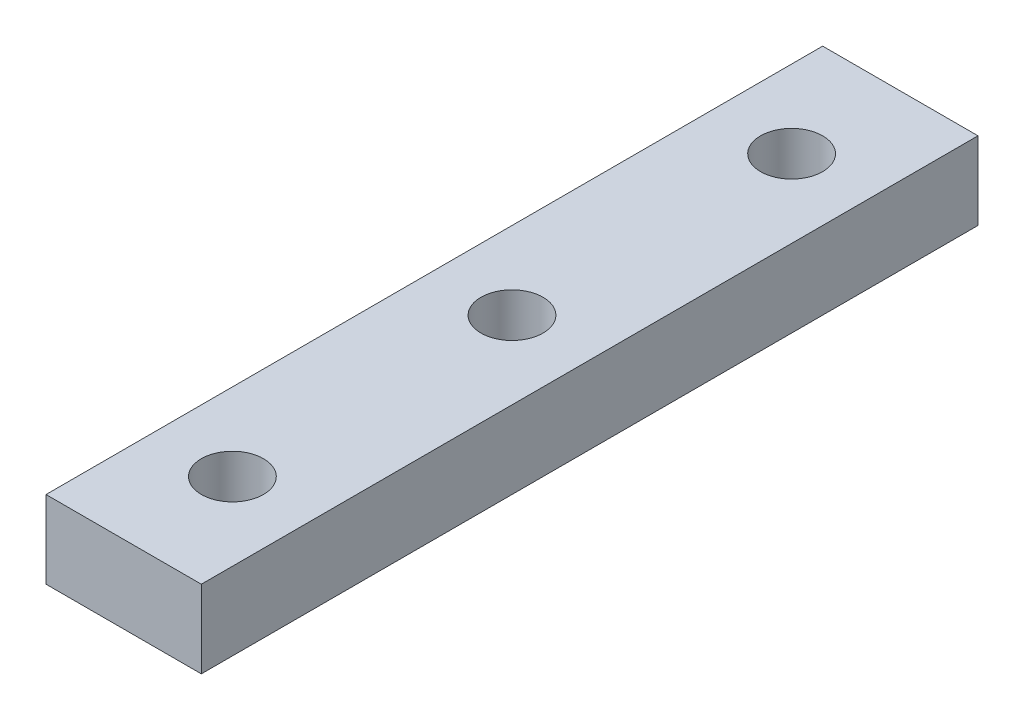
ISO-10303-21;
HEADER;
FILE_DESCRIPTION(('STEP AP214'),'2;1');
FILE_NAME('part.step','',(''),(''),'','','');
FILE_SCHEMA(('AUTOMOTIVE_DESIGN { 1 0 10303 214 1 1 1 1 }'));
ENDSEC;
DATA;
#1=APPLICATION_CONTEXT('core data for automotive mechanical design processes');
#2=APPLICATION_PROTOCOL_DEFINITION('international standard','automotive_design',2000,#1);
#3=PRODUCT_CONTEXT('',#1,'mechanical');
#4=PRODUCT('Part','Part','',(#3));
#5=PRODUCT_RELATED_PRODUCT_CATEGORY('part','',(#4));
#6=PRODUCT_DEFINITION_FORMATION('','',#4);
#7=PRODUCT_DEFINITION_CONTEXT('part definition',#1,'design');
#8=PRODUCT_DEFINITION('design','',#6,#7);
#9=PRODUCT_DEFINITION_SHAPE('','',#8);
#10=(LENGTH_UNIT() NAMED_UNIT(*) SI_UNIT(.MILLI.,.METRE.));
#11=(NAMED_UNIT(*) PLANE_ANGLE_UNIT() SI_UNIT($,.RADIAN.));
#12=(NAMED_UNIT(*) SI_UNIT($,.STERADIAN.) SOLID_ANGLE_UNIT());
#13=UNCERTAINTY_MEASURE_WITH_UNIT(LENGTH_MEASURE(1.E-05),#10,'distance_accuracy_value','');
#14=(GEOMETRIC_REPRESENTATION_CONTEXT(3) GLOBAL_UNCERTAINTY_ASSIGNED_CONTEXT((#13)) GLOBAL_UNIT_ASSIGNED_CONTEXT((#10,
#11,#12)) REPRESENTATION_CONTEXT('',''));
#15=CARTESIAN_POINT('',(0.,0.,0.));
#16=DIRECTION('',(0.,0.,1.));
#17=DIRECTION('',(1.,0.,0.));
#18=AXIS2_PLACEMENT_3D('',#15,#16,#17);
#19=CARTESIAN_POINT('',(-5.,2.5,50.));
#20=DIRECTION('',(1.,0.,0.));
#21=DIRECTION('',(0.,1.,0.));
#22=AXIS2_PLACEMENT_3D('',#19,#20,#21);
#23=PLANE('',#22);
#24=DIRECTION('',(0.,-1.,0.));
#25=VECTOR('',#24,1.);
#26=CARTESIAN_POINT('',(-5.,2.5,0.));
#27=LINE('',#26,#25);
#28=CARTESIAN_POINT('',(-5.,2.5,0.));
#29=VERTEX_POINT('',#28);
#30=CARTESIAN_POINT('',(-5.,-2.5,0.));
#31=VERTEX_POINT('',#30);
#32=EDGE_CURVE('E95',#29,#31,#27,.T.);
#33=ORIENTED_EDGE('',*,*,#32,.T.);
#34=DIRECTION('',(0.,0.,-1.));
#35=VECTOR('',#34,1.);
#36=CARTESIAN_POINT('',(-5.,-2.5,50.));
#37=LINE('',#36,#35);
#38=CARTESIAN_POINT('',(-5.,-2.5,50.));
#39=VERTEX_POINT('',#38);
#40=EDGE_CURVE('E11',#39,#31,#37,.T.);
#41=ORIENTED_EDGE('',*,*,#40,.F.);
#42=DIRECTION('',(0.,-1.,0.));
#43=VECTOR('',#42,1.);
#44=CARTESIAN_POINT('',(-5.,2.5,50.));
#45=LINE('',#44,#43);
#46=CARTESIAN_POINT('',(-5.,2.5,50.));
#47=VERTEX_POINT('',#46);
#48=EDGE_CURVE('E83',#47,#39,#45,.T.);
#49=ORIENTED_EDGE('',*,*,#48,.F.);
#50=DIRECTION('',(0.,0.,-1.));
#51=VECTOR('',#50,1.);
#52=CARTESIAN_POINT('',(-5.,2.5,50.));
#53=LINE('',#52,#51);
#54=EDGE_CURVE('E91',#47,#29,#53,.T.);
#55=ORIENTED_EDGE('',*,*,#54,.T.);
#56=EDGE_LOOP('',(#33,#41,#49,#55));
#57=FACE_BOUND('',#56,.T.);
#58=ADVANCED_FACE('F32',(#57),#23,.F.);
#59=CARTESIAN_POINT('',(-5.,-2.5,50.));
#60=DIRECTION('',(0.,1.,0.));
#61=DIRECTION('',(-1.,0.,0.));
#62=AXIS2_PLACEMENT_3D('',#59,#60,#61);
#63=PLANE('',#62);
#64=CARTESIAN_POINT('',(0.,-2.5,43.));
#65=DIRECTION('',(0.,1.,0.));
#66=DIRECTION('',(-1.,0.,0.));
#67=AXIS2_PLACEMENT_3D('',#64,#65,#66);
#68=CIRCLE('',#67,2.);
#69=CARTESIAN_POINT('',(-2.,-2.5,43.));
#70=VERTEX_POINT('',#69);
#71=EDGE_CURVE('E98',#70,#70,#68,.T.);
#72=ORIENTED_EDGE('',*,*,#71,.T.);
#73=EDGE_LOOP('',(#72));
#74=FACE_BOUND('',#73,.T.);
#75=CARTESIAN_POINT('',(0.,-2.5,25.));
#76=DIRECTION('',(0.,1.,0.));
#77=DIRECTION('',(-1.,0.,0.));
#78=AXIS2_PLACEMENT_3D('',#75,#76,#77);
#79=CIRCLE('',#78,2.);
#80=CARTESIAN_POINT('',(-2.,-2.5,25.));
#81=VERTEX_POINT('',#80);
#82=EDGE_CURVE('E111',#81,#81,#79,.T.);
#83=ORIENTED_EDGE('',*,*,#82,.T.);
#84=EDGE_LOOP('',(#83));
#85=FACE_BOUND('',#84,.T.);
#86=CARTESIAN_POINT('',(0.,-2.5,7.));
#87=DIRECTION('',(0.,1.,0.));
#88=DIRECTION('',(-1.,0.,0.));
#89=AXIS2_PLACEMENT_3D('',#86,#87,#88);
#90=CIRCLE('',#89,2.);
#91=CARTESIAN_POINT('',(-2.,-2.5,7.));
#92=VERTEX_POINT('',#91);
#93=EDGE_CURVE('E114',#92,#92,#90,.T.);
#94=ORIENTED_EDGE('',*,*,#93,.T.);
#95=EDGE_LOOP('',(#94));
#96=FACE_BOUND('',#95,.T.);
#97=DIRECTION('',(1.,0.,0.));
#98=VECTOR('',#97,1.);
#99=CARTESIAN_POINT('',(-5.,-2.5,0.));
#100=LINE('',#99,#98);
#101=CARTESIAN_POINT('',(5.,-2.5,0.));
#102=VERTEX_POINT('',#101);
#103=EDGE_CURVE('E87',#31,#102,#100,.T.);
#104=ORIENTED_EDGE('',*,*,#103,.T.);
#105=DIRECTION('',(0.,0.,-1.));
#106=VECTOR('',#105,1.);
#107=CARTESIAN_POINT('',(5.,-2.5,50.));
#108=LINE('',#107,#106);
#109=CARTESIAN_POINT('',(5.,-2.5,50.));
#110=VERTEX_POINT('',#109);
#111=EDGE_CURVE('E40',#110,#102,#108,.T.);
#112=ORIENTED_EDGE('',*,*,#111,.F.);
#113=DIRECTION('',(1.,0.,0.));
#114=VECTOR('',#113,1.);
#115=CARTESIAN_POINT('',(-5.,-2.5,50.));
#116=LINE('',#115,#114);
#117=EDGE_CURVE('E78',#39,#110,#116,.T.);
#118=ORIENTED_EDGE('',*,*,#117,.F.);
#119=ORIENTED_EDGE('',*,*,#40,.T.);
#120=EDGE_LOOP('',(#104,#112,#118,#119));
#121=FACE_BOUND('',#120,.T.);
#122=ADVANCED_FACE('F86',(#74,#85,#96,#121),#63,.F.);
#123=CARTESIAN_POINT('',(5.,2.5,50.));
#124=DIRECTION('',(-1.,0.,0.));
#125=DIRECTION('',(0.,-1.,0.));
#126=AXIS2_PLACEMENT_3D('',#123,#124,#125);
#127=PLANE('',#126);
#128=DIRECTION('',(0.,1.,0.));
#129=VECTOR('',#128,1.);
#130=CARTESIAN_POINT('',(5.,2.5,0.));
#131=LINE('',#130,#129);
#132=CARTESIAN_POINT('',(5.,2.5,0.));
#133=VERTEX_POINT('',#132);
#134=EDGE_CURVE('E65',#102,#133,#131,.T.);
#135=ORIENTED_EDGE('',*,*,#134,.T.);
#136=DIRECTION('',(0.,0.,-1.));
#137=VECTOR('',#136,1.);
#138=CARTESIAN_POINT('',(5.,2.5,50.));
#139=LINE('',#138,#137);
#140=CARTESIAN_POINT('',(5.,2.5,50.));
#141=VERTEX_POINT('',#140);
#142=EDGE_CURVE('E88',#141,#133,#139,.T.);
#143=ORIENTED_EDGE('',*,*,#142,.F.);
#144=DIRECTION('',(0.,1.,0.));
#145=VECTOR('',#144,1.);
#146=CARTESIAN_POINT('',(5.,2.5,50.));
#147=LINE('',#146,#145);
#148=EDGE_CURVE('E81',#110,#141,#147,.T.);
#149=ORIENTED_EDGE('',*,*,#148,.F.);
#150=ORIENTED_EDGE('',*,*,#111,.T.);
#151=EDGE_LOOP('',(#135,#143,#149,#150));
#152=FACE_BOUND('',#151,.T.);
#153=ADVANCED_FACE('F89',(#152),#127,.F.);
#154=CARTESIAN_POINT('',(-5.,2.5,50.));
#155=DIRECTION('',(0.,-1.,0.));
#156=DIRECTION('',(1.,0.,0.));
#157=AXIS2_PLACEMENT_3D('',#154,#155,#156);
#158=PLANE('',#157);
#159=CARTESIAN_POINT('',(0.,2.5,43.));
#160=DIRECTION('',(0.,1.,0.));
#161=DIRECTION('',(-1.,0.,0.));
#162=AXIS2_PLACEMENT_3D('',#159,#160,#161);
#163=CIRCLE('',#162,2.);
#164=CARTESIAN_POINT('',(-2.,2.5,43.));
#165=VERTEX_POINT('',#164);
#166=EDGE_CURVE('E117',#165,#165,#163,.T.);
#167=ORIENTED_EDGE('',*,*,#166,.F.);
#168=EDGE_LOOP('',(#167));
#169=FACE_BOUND('',#168,.T.);
#170=CARTESIAN_POINT('',(0.,2.5,25.));
#171=DIRECTION('',(0.,1.,0.));
#172=DIRECTION('',(-1.,0.,0.));
#173=AXIS2_PLACEMENT_3D('',#170,#171,#172);
#174=CIRCLE('',#173,2.);
#175=CARTESIAN_POINT('',(-2.,2.5,25.));
#176=VERTEX_POINT('',#175);
#177=EDGE_CURVE('E121',#176,#176,#174,.T.);
#178=ORIENTED_EDGE('',*,*,#177,.F.);
#179=EDGE_LOOP('',(#178));
#180=FACE_BOUND('',#179,.T.);
#181=CARTESIAN_POINT('',(0.,2.5,7.));
#182=DIRECTION('',(0.,1.,0.));
#183=DIRECTION('',(-1.,0.,0.));
#184=AXIS2_PLACEMENT_3D('',#181,#182,#183);
#185=CIRCLE('',#184,2.);
#186=CARTESIAN_POINT('',(-2.,2.5,7.));
#187=VERTEX_POINT('',#186);
#188=EDGE_CURVE('E118',#187,#187,#185,.T.);
#189=ORIENTED_EDGE('',*,*,#188,.F.);
#190=EDGE_LOOP('',(#189));
#191=FACE_BOUND('',#190,.T.);
#192=DIRECTION('',(-1.,0.,0.));
#193=VECTOR('',#192,1.);
#194=CARTESIAN_POINT('',(-5.,2.5,0.));
#195=LINE('',#194,#193);
#196=EDGE_CURVE('E71',#133,#29,#195,.T.);
#197=ORIENTED_EDGE('',*,*,#196,.T.);
#198=ORIENTED_EDGE('',*,*,#54,.F.);
#199=DIRECTION('',(-1.,0.,0.));
#200=VECTOR('',#199,1.);
#201=CARTESIAN_POINT('',(-5.,2.5,50.));
#202=LINE('',#201,#200);
#203=EDGE_CURVE('E48',#141,#47,#202,.T.);
#204=ORIENTED_EDGE('',*,*,#203,.F.);
#205=ORIENTED_EDGE('',*,*,#142,.T.);
#206=EDGE_LOOP('',(#197,#198,#204,#205));
#207=FACE_BOUND('',#206,.T.);
#208=ADVANCED_FACE('F103',(#169,#180,#191,#207),#158,.F.);
#209=CARTESIAN_POINT('',(0.,0.,50.));
#210=DIRECTION('',(0.,0.,1.));
#211=DIRECTION('',(1.,0.,0.));
#212=AXIS2_PLACEMENT_3D('',#209,#210,#211);
#213=PLANE('',#212);
#214=ORIENTED_EDGE('',*,*,#48,.T.);
#215=ORIENTED_EDGE('',*,*,#117,.T.);
#216=ORIENTED_EDGE('',*,*,#148,.T.);
#217=ORIENTED_EDGE('',*,*,#203,.T.);
#218=EDGE_LOOP('',(#214,#215,#216,#217));
#219=FACE_BOUND('',#218,.T.);
#220=ADVANCED_FACE('F79',(#219),#213,.T.);
#221=CARTESIAN_POINT('',(0.,0.,0.));
#222=DIRECTION('',(0.,0.,1.));
#223=DIRECTION('',(1.,0.,0.));
#224=AXIS2_PLACEMENT_3D('',#221,#222,#223);
#225=PLANE('',#224);
#226=ORIENTED_EDGE('',*,*,#32,.F.);
#227=ORIENTED_EDGE('',*,*,#196,.F.);
#228=ORIENTED_EDGE('',*,*,#134,.F.);
#229=ORIENTED_EDGE('',*,*,#103,.F.);
#230=EDGE_LOOP('',(#226,#227,#228,#229));
#231=FACE_BOUND('',#230,.T.);
#232=ADVANCED_FACE('F106',(#231),#225,.F.);
#233=CARTESIAN_POINT('',(0.,-7.5,7.));
#234=DIRECTION('',(0.,1.,0.));
#235=DIRECTION('',(-1.,0.,0.));
#236=AXIS2_PLACEMENT_3D('',#233,#234,#235);
#237=CYLINDRICAL_SURFACE('',#236,2.);
#238=ORIENTED_EDGE('',*,*,#188,.T.);
#239=EDGE_LOOP('',(#238));
#240=FACE_BOUND('',#239,.T.);
#241=ORIENTED_EDGE('',*,*,#93,.F.);
#242=EDGE_LOOP('',(#241));
#243=FACE_BOUND('',#242,.T.);
#244=ADVANCED_FACE('F137',(#240,#243),#237,.F.);
#245=CARTESIAN_POINT('',(0.,-7.5,25.));
#246=DIRECTION('',(0.,1.,0.));
#247=DIRECTION('',(-1.,0.,0.));
#248=AXIS2_PLACEMENT_3D('',#245,#246,#247);
#249=CYLINDRICAL_SURFACE('',#248,2.);
#250=ORIENTED_EDGE('',*,*,#177,.T.);
#251=EDGE_LOOP('',(#250));
#252=FACE_BOUND('',#251,.T.);
#253=ORIENTED_EDGE('',*,*,#82,.F.);
#254=EDGE_LOOP('',(#253));
#255=FACE_BOUND('',#254,.T.);
#256=ADVANCED_FACE('F140',(#252,#255),#249,.F.);
#257=CARTESIAN_POINT('',(0.,-7.5,43.));
#258=DIRECTION('',(0.,1.,0.));
#259=DIRECTION('',(-1.,0.,0.));
#260=AXIS2_PLACEMENT_3D('',#257,#258,#259);
#261=CYLINDRICAL_SURFACE('',#260,2.);
#262=ORIENTED_EDGE('',*,*,#166,.T.);
#263=EDGE_LOOP('',(#262));
#264=FACE_BOUND('',#263,.T.);
#265=ORIENTED_EDGE('',*,*,#71,.F.);
#266=EDGE_LOOP('',(#265));
#267=FACE_BOUND('',#266,.T.);
#268=ADVANCED_FACE('F127',(#264,#267),#261,.F.);
#269=CLOSED_SHELL('',(#58,#122,#153,#208,#220,#232,#244,#256,#268));
#270=MANIFOLD_SOLID_BREP('B2',#269);
#271=ADVANCED_BREP_SHAPE_REPRESENTATION('',(#18,#270),#14);
#272=SHAPE_DEFINITION_REPRESENTATION(#9,#271);
ENDSEC;
END-ISO-10303-21;
